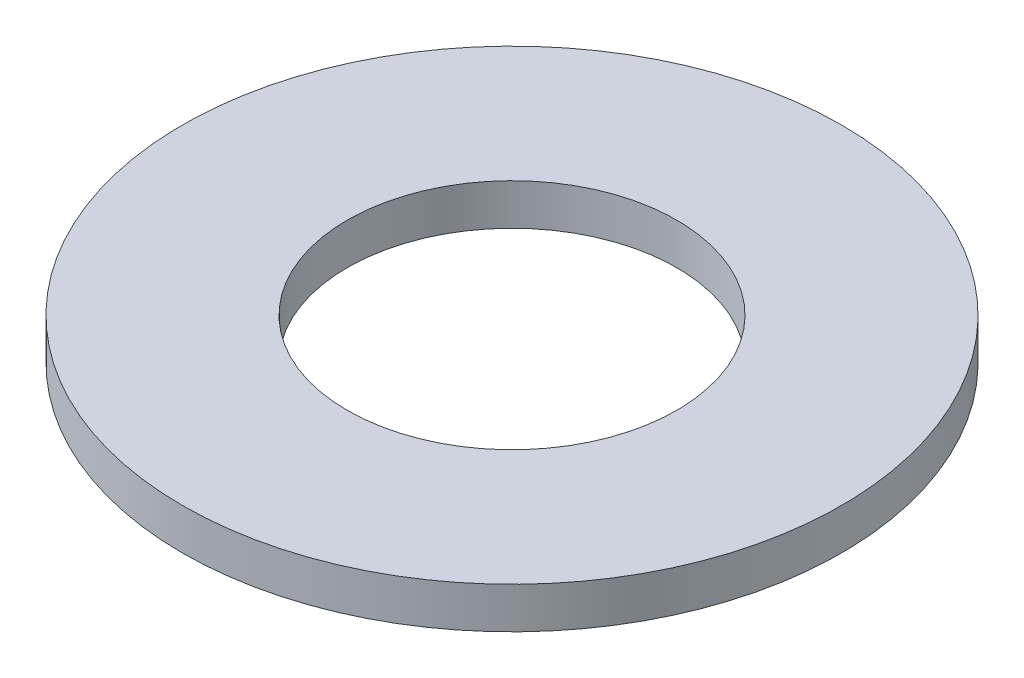
ISO-10303-21;
HEADER;
FILE_DESCRIPTION(('STEP AP214'),'2;1');
FILE_NAME('part.step','',(''),(''),'','','');
FILE_SCHEMA(('AUTOMOTIVE_DESIGN { 1 0 10303 214 1 1 1 1 }'));
ENDSEC;
DATA;
#1=APPLICATION_CONTEXT('core data for automotive mechanical design processes');
#2=APPLICATION_PROTOCOL_DEFINITION('international standard','automotive_design',2000,#1);
#3=PRODUCT_CONTEXT('',#1,'mechanical');
#4=PRODUCT('Part','Part','',(#3));
#5=PRODUCT_RELATED_PRODUCT_CATEGORY('part','',(#4));
#6=PRODUCT_DEFINITION_FORMATION('','',#4);
#7=PRODUCT_DEFINITION_CONTEXT('part definition',#1,'design');
#8=PRODUCT_DEFINITION('design','',#6,#7);
#9=PRODUCT_DEFINITION_SHAPE('','',#8);
#10=(LENGTH_UNIT() NAMED_UNIT(*) SI_UNIT(.MILLI.,.METRE.));
#11=(NAMED_UNIT(*) PLANE_ANGLE_UNIT() SI_UNIT($,.RADIAN.));
#12=(NAMED_UNIT(*) SI_UNIT($,.STERADIAN.) SOLID_ANGLE_UNIT());
#13=UNCERTAINTY_MEASURE_WITH_UNIT(LENGTH_MEASURE(1.E-05),#10,'distance_accuracy_value','');
#14=(GEOMETRIC_REPRESENTATION_CONTEXT(3) GLOBAL_UNCERTAINTY_ASSIGNED_CONTEXT((#13)) GLOBAL_UNIT_ASSIGNED_CONTEXT((#10,
#11,#12)) REPRESENTATION_CONTEXT('',''));
#15=CARTESIAN_POINT('',(0.,0.,0.));
#16=DIRECTION('',(0.,0.,1.));
#17=DIRECTION('',(1.,0.,0.));
#18=AXIS2_PLACEMENT_3D('',#15,#16,#17);
#19=CARTESIAN_POINT('',(0.,3.175,0.));
#20=DIRECTION('',(0.,1.,0.));
#21=DIRECTION('',(0.,0.,1.));
#22=AXIS2_PLACEMENT_3D('',#19,#20,#21);
#23=PLANE('',#22);
#24=CARTESIAN_POINT('',(0.,3.175,0.));
#25=DIRECTION('',(0.,1.,0.));
#26=DIRECTION('',(0.,0.,1.));
#27=AXIS2_PLACEMENT_3D('',#24,#25,#26);
#28=CIRCLE('',#27,25.4);
#29=CARTESIAN_POINT('',(0.,3.175,25.4));
#30=VERTEX_POINT('',#29);
#31=EDGE_CURVE('E10',#30,#30,#28,.T.);
#32=ORIENTED_EDGE('',*,*,#31,.T.);
#33=EDGE_LOOP('',(#32));
#34=FACE_BOUND('',#33,.T.);
#35=CARTESIAN_POINT('',(0.,3.175,0.));
#36=DIRECTION('',(0.,1.,0.));
#37=DIRECTION('',(0.,0.,1.));
#38=AXIS2_PLACEMENT_3D('',#35,#36,#37);
#39=CIRCLE('',#38,12.7);
#40=CARTESIAN_POINT('',(0.,3.175,12.7));
#41=VERTEX_POINT('',#40);
#42=EDGE_CURVE('E42',#41,#41,#39,.T.);
#43=ORIENTED_EDGE('',*,*,#42,.F.);
#44=EDGE_LOOP('',(#43));
#45=FACE_BOUND('',#44,.T.);
#46=ADVANCED_FACE('F31',(#34,#45),#23,.T.);
#47=CARTESIAN_POINT('',(0.,0.,0.));
#48=DIRECTION('',(0.,1.,0.));
#49=DIRECTION('',(0.,0.,1.));
#50=AXIS2_PLACEMENT_3D('',#47,#48,#49);
#51=PLANE('',#50);
#52=CARTESIAN_POINT('',(0.,0.,0.));
#53=DIRECTION('',(0.,1.,0.));
#54=DIRECTION('',(0.,0.,1.));
#55=AXIS2_PLACEMENT_3D('',#52,#53,#54);
#56=CIRCLE('',#55,25.4);
#57=CARTESIAN_POINT('',(0.,0.,25.4));
#58=VERTEX_POINT('',#57);
#59=EDGE_CURVE('E35',#58,#58,#56,.T.);
#60=ORIENTED_EDGE('',*,*,#59,.F.);
#61=EDGE_LOOP('',(#60));
#62=FACE_BOUND('',#61,.T.);
#63=CARTESIAN_POINT('',(0.,0.,0.));
#64=DIRECTION('',(0.,1.,0.));
#65=DIRECTION('',(0.,0.,1.));
#66=AXIS2_PLACEMENT_3D('',#63,#64,#65);
#67=CIRCLE('',#66,12.7);
#68=CARTESIAN_POINT('',(0.,0.,12.7));
#69=VERTEX_POINT('',#68);
#70=EDGE_CURVE('E44',#69,#69,#67,.T.);
#71=ORIENTED_EDGE('',*,*,#70,.T.);
#72=EDGE_LOOP('',(#71));
#73=FACE_BOUND('',#72,.T.);
#74=ADVANCED_FACE('F54',(#62,#73),#51,.F.);
#75=CARTESIAN_POINT('',(0.,3.175,0.));
#76=DIRECTION('',(0.,-1.,0.));
#77=DIRECTION('',(0.,0.,-1.));
#78=AXIS2_PLACEMENT_3D('',#75,#76,#77);
#79=CYLINDRICAL_SURFACE('',#78,25.4);
#80=ORIENTED_EDGE('',*,*,#31,.F.);
#81=EDGE_LOOP('',(#80));
#82=FACE_BOUND('',#81,.T.);
#83=ORIENTED_EDGE('',*,*,#59,.T.);
#84=EDGE_LOOP('',(#83));
#85=FACE_BOUND('',#84,.T.);
#86=ADVANCED_FACE('F33',(#82,#85),#79,.T.);
#87=CARTESIAN_POINT('',(0.,3.175,0.));
#88=DIRECTION('',(0.,-1.,0.));
#89=DIRECTION('',(0.,0.,-1.));
#90=AXIS2_PLACEMENT_3D('',#87,#88,#89);
#91=CYLINDRICAL_SURFACE('',#90,12.7);
#92=ORIENTED_EDGE('',*,*,#42,.T.);
#93=EDGE_LOOP('',(#92));
#94=FACE_BOUND('',#93,.T.);
#95=ORIENTED_EDGE('',*,*,#70,.F.);
#96=EDGE_LOOP('',(#95));
#97=FACE_BOUND('',#96,.T.);
#98=ADVANCED_FACE('F50',(#94,#97),#91,.F.);
#99=CLOSED_SHELL('',(#46,#74,#86,#98));
#100=MANIFOLD_SOLID_BREP('B2',#99);
#101=ADVANCED_BREP_SHAPE_REPRESENTATION('',(#18,#100),#14);
#102=SHAPE_DEFINITION_REPRESENTATION(#9,#101);
ENDSEC;
END-ISO-10303-21;
